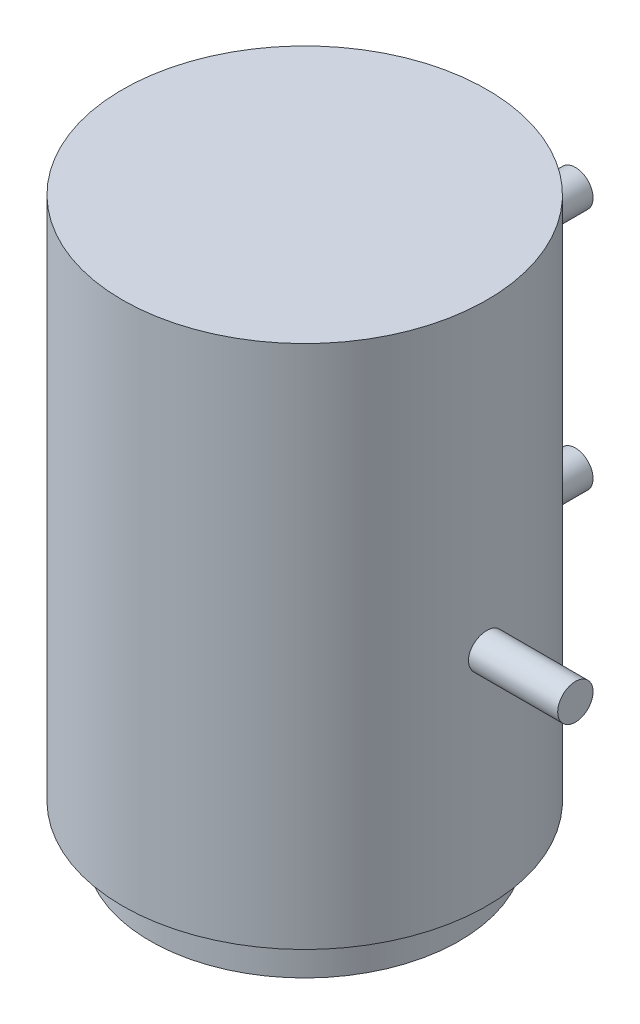
ISO-10303-21;
HEADER;
FILE_DESCRIPTION(('STEP AP214'),'2;1');
FILE_NAME('part.step','',(''),(''),'','','');
FILE_SCHEMA(('AUTOMOTIVE_DESIGN { 1 0 10303 214 1 1 1 1 }'));
ENDSEC;
DATA;
#1=APPLICATION_CONTEXT('core data for automotive mechanical design processes');
#2=APPLICATION_PROTOCOL_DEFINITION('international standard','automotive_design',2000,#1);
#3=PRODUCT_CONTEXT('',#1,'mechanical');
#4=PRODUCT('Part','Part','',(#3));
#5=PRODUCT_RELATED_PRODUCT_CATEGORY('part','',(#4));
#6=PRODUCT_DEFINITION_FORMATION('','',#4);
#7=PRODUCT_DEFINITION_CONTEXT('part definition',#1,'design');
#8=PRODUCT_DEFINITION('design','',#6,#7);
#9=PRODUCT_DEFINITION_SHAPE('','',#8);
#10=(LENGTH_UNIT() NAMED_UNIT(*) SI_UNIT(.MILLI.,.METRE.));
#11=(NAMED_UNIT(*) PLANE_ANGLE_UNIT() SI_UNIT($,.RADIAN.));
#12=(NAMED_UNIT(*) SI_UNIT($,.STERADIAN.) SOLID_ANGLE_UNIT());
#13=UNCERTAINTY_MEASURE_WITH_UNIT(LENGTH_MEASURE(1.E-05),#10,'distance_accuracy_value','');
#14=(GEOMETRIC_REPRESENTATION_CONTEXT(3) GLOBAL_UNCERTAINTY_ASSIGNED_CONTEXT((#13)) GLOBAL_UNIT_ASSIGNED_CONTEXT((#10,
#11,#12)) REPRESENTATION_CONTEXT('',''));
#15=CARTESIAN_POINT('',(0.,0.,0.));
#16=DIRECTION('',(0.,0.,1.));
#17=DIRECTION('',(1.,0.,0.));
#18=AXIS2_PLACEMENT_3D('',#15,#16,#17);
#19=CARTESIAN_POINT('',(0.,47.5,0.));
#20=DIRECTION('',(0.,-1.,0.));
#21=DIRECTION('',(0.,0.,-1.));
#22=AXIS2_PLACEMENT_3D('',#19,#20,#21);
#23=CYLINDRICAL_SURFACE('',#22,16.5);
#24=CARTESIAN_POINT('',(0.,47.5,0.));
#25=DIRECTION('',(0.,1.,0.));
#26=DIRECTION('',(0.,0.,1.));
#27=AXIS2_PLACEMENT_3D('',#24,#25,#26);
#28=CIRCLE('',#27,16.5);
#29=CARTESIAN_POINT('',(0.,47.5,16.5));
#30=VERTEX_POINT('',#29);
#31=EDGE_CURVE('E101',#30,#30,#28,.T.);
#32=ORIENTED_EDGE('',*,*,#31,.F.);
#33=EDGE_LOOP('',(#32));
#34=FACE_BOUND('',#33,.T.);
#35=CARTESIAN_POINT('',(0.,0.,0.));
#36=DIRECTION('',(0.,1.,0.));
#37=DIRECTION('',(0.,0.,1.));
#38=AXIS2_PLACEMENT_3D('',#35,#36,#37);
#39=CIRCLE('',#38,16.5);
#40=CARTESIAN_POINT('',(0.,0.,16.5));
#41=VERTEX_POINT('',#40);
#42=EDGE_CURVE('E105',#41,#41,#39,.T.);
#43=ORIENTED_EDGE('',*,*,#42,.T.);
#44=EDGE_LOOP('',(#43));
#45=FACE_BOUND('',#44,.T.);
#46=CARTESIAN_POINT('',(0.,37.4004609131315,-16.5));
#47=CARTESIAN_POINT('',(0.0896468472072853,37.4004570241778,-16.4999989964101));
#48=CARTESIAN_POINT('',(0.179353307864555,37.3929012788737,-16.4992616357271));
#49=CARTESIAN_POINT('',(0.356280195687039,37.3628734406754,-16.4963910597331));
#50=CARTESIAN_POINT('',(0.44349775702248,37.3403848232219,-16.4942562981101));
#51=CARTESIAN_POINT('',(0.612859080677685,37.2811512184033,-16.4888319477223));
#52=CARTESIAN_POINT('',(0.695005835846317,37.2444147353797,-16.4855430479569));
#53=CARTESIAN_POINT('',(0.851948953325358,37.1577444746024,-16.4781783875371));
#54=CARTESIAN_POINT('',(0.926746794644606,37.1078133598343,-16.4741027857023));
#55=CARTESIAN_POINT('',(1.06714097089595,36.9959891364894,-16.4656059512469));
#56=CARTESIAN_POINT('',(1.13270887311799,36.9340604040171,-16.4611837132571));
#57=CARTESIAN_POINT('',(1.2525376384802,36.8000747446645,-16.452500357178));
#58=CARTESIAN_POINT('',(1.3067979838941,36.7280173542877,-16.4482392464734));
#59=CARTESIAN_POINT('',(1.40257130189849,36.5756428851413,-16.4403502355562));
#60=CARTESIAN_POINT('',(1.44405867624009,36.495309645044,-16.4367236131145));
#61=CARTESIAN_POINT('',(1.51294491511269,36.3287760135604,-16.4305264965383));
#62=CARTESIAN_POINT('',(1.54034410823927,36.2425757590707,-16.4279559777713));
#63=CARTESIAN_POINT('',(1.58019224922932,36.0670441151195,-16.424171089116));
#64=CARTESIAN_POINT('',(1.59268821168734,35.9777234921045,-16.4229524553472));
#65=CARTESIAN_POINT('',(1.60252049054395,35.798245039936,-16.4219960354741));
#66=CARTESIAN_POINT('',(1.59985718310181,35.7080872316116,-16.4222582126252));
#67=CARTESIAN_POINT('',(1.57948529424905,35.5298173734584,-16.424229901502));
#68=CARTESIAN_POINT('',(1.56182799966462,35.4416994005675,-16.4259344794366));
#69=CARTESIAN_POINT('',(1.51204913968636,35.2696835945119,-16.4305911942263));
#70=CARTESIAN_POINT('',(1.47992738941082,35.185785815304,-16.4335433470277));
#71=CARTESIAN_POINT('',(1.40207466745634,35.0244296553668,-16.4403682565936));
#72=CARTESIAN_POINT('',(1.35632089164593,34.9469823452025,-16.4442425537518));
#73=CARTESIAN_POINT('',(1.25251929679395,34.800846695686,-16.4524738914759));
#74=CARTESIAN_POINT('',(1.19447113953268,34.7321585973838,-16.4568309453208));
#75=CARTESIAN_POINT('',(1.06744187143553,34.6051931136989,-16.4655588452169));
#76=CARTESIAN_POINT('',(0.998416459169538,34.546960041591,-16.4699296736173));
#77=CARTESIAN_POINT('',(0.851546032359735,34.4429009313146,-16.478175564523));
#78=CARTESIAN_POINT('',(0.77370100880076,34.3970749058284,-16.4820506265215));
#79=CARTESIAN_POINT('',(0.611370762232357,34.3191326903597,-16.488869533322));
#80=CARTESIAN_POINT('',(0.526884479833608,34.2870186929462,-16.4918132291781));
#81=CARTESIAN_POINT('',(0.353684201743435,34.2374443253599,-16.496436175699));
#82=CARTESIAN_POINT('',(0.264970324988621,34.2199835431994,-16.4981154619138));
#83=CARTESIAN_POINT('',(0.0862169415722778,34.2002673420357,-16.5000158131697));
#84=CARTESIAN_POINT('',(-0.00381575943655131,34.1979507624561,-16.5002427435404));
#85=CARTESIAN_POINT('',(-0.182988154084999,34.2084281703873,-16.4992285294652));
#86=CARTESIAN_POINT('',(-0.272127859042658,34.2212219661408,-16.4979874036497));
#87=CARTESIAN_POINT('',(-0.446807802909054,34.2615062255212,-16.4941803263464));
#88=CARTESIAN_POINT('',(-0.532354693905177,34.2889681085695,-16.4916169515754));
#89=CARTESIAN_POINT('',(-0.697627281978256,34.3577796640838,-16.485453026532));
#90=CARTESIAN_POINT('',(-0.77735285590424,34.399129630251,-16.4818524543256));
#91=CARTESIAN_POINT('',(-0.928996572726879,34.4946956503564,-16.4740024388171));
#92=CARTESIAN_POINT('',(-1.00088924495442,34.5489519528979,-16.4697509808044));
#93=CARTESIAN_POINT('',(-1.13456870258934,34.6687327147321,-16.4610828889791));
#94=CARTESIAN_POINT('',(-1.19635524964773,34.7342574397112,-16.4566662512739));
#95=CARTESIAN_POINT('',(-1.30828042110192,34.874981619016,-16.4481479900473));
#96=CARTESIAN_POINT('',(-1.35837895009174,34.9502130403065,-16.4440474822902));
#97=CARTESIAN_POINT('',(-1.44523047769575,35.1080571154782,-16.4366425072072));
#98=CARTESIAN_POINT('',(-1.48198364934787,35.190669673637,-16.4333380295601));
#99=CARTESIAN_POINT('',(-1.5410338209711,35.3607925786967,-16.4279060941151));
#100=CARTESIAN_POINT('',(-1.56335481172441,35.4482945334059,-16.4257766838572));
#101=CARTESIAN_POINT('',(-1.59298490511546,35.6258260097101,-16.422929829592));
#102=CARTESIAN_POINT('',(-1.60029441033257,35.7158554634567,-16.4222123477195));
#103=CARTESIAN_POINT('',(-1.59968864115444,35.8954878261391,-16.4222713363689));
#104=CARTESIAN_POINT('',(-1.59183635355644,35.9850909561852,-16.4230416262288));
#105=CARTESIAN_POINT('',(-1.56126182021458,36.1616989004317,-16.4259761965129));
#106=CARTESIAN_POINT('',(-1.53853955645238,36.2487037114835,-16.4281404786262));
#107=CARTESIAN_POINT('',(-1.47888718274058,36.4176456691619,-16.4336174761021));
#108=CARTESIAN_POINT('',(-1.44195878646557,36.49958342564,-16.436930052942));
#109=CARTESIAN_POINT('',(-1.3549489913268,36.656107477535,-16.4443306725105));
#110=CARTESIAN_POINT('',(-1.30486769187971,36.7306938285118,-16.4484187093778));
#111=CARTESIAN_POINT('',(-1.19273704605056,36.8707206126834,-16.456929952389));
#112=CARTESIAN_POINT('',(-1.13064080117923,36.9361234140011,-16.4613544292931));
#113=CARTESIAN_POINT('',(-0.996334643101315,37.0556090403434,-16.4700284061561));
#114=CARTESIAN_POINT('',(-0.92412230630098,37.1096891449304,-16.4742778638676));
#115=CARTESIAN_POINT('',(-0.771446831714418,37.2050943872768,-16.4821334291007));
#116=CARTESIAN_POINT('',(-0.690964405934935,37.2463887629259,-16.4857379763316));
#117=CARTESIAN_POINT('',(-0.524225147989652,37.3148226400725,-16.4918804097023));
#118=CARTESIAN_POINT('',(-0.437974976842079,37.3419781621515,-16.4944195024607));
#119=CARTESIAN_POINT('',(-0.292693706489168,37.374563878306,-16.4975042386956));
#120=CARTESIAN_POINT('',(-0.234592456617577,37.3842620682817,-16.4984358052133));
#121=CARTESIAN_POINT('',(-0.117669365334526,37.3972118498036,-16.4996840140874));
#122=CARTESIAN_POINT('',(-0.0588475266776659,37.4004634659854,-16.5000006587937));
#123=CARTESIAN_POINT('',(0.,37.4004609131315,-16.5));
#124=B_SPLINE_CURVE_WITH_KNOTS('',3,(#46,#47,#48,#49,#50,#51,#52,#53,#54,#55,#56,#57,#58,#59,
#60,#61,#62,#63,#64,#65,#66,#67,#68,#69,#70,#71,#72,#73,#74,#75,#76,#77,#78,#79,#80,#81,#82,#83,
#84,#85,#86,#87,#88,#89,#90,#91,#92,#93,#94,#95,#96,#97,#98,#99,#100,#101,#102,#103,#104,#105,
#106,#107,#108,#109,#110,#111,#112,#113,#114,#115,#116,#117,#118,#119,#120,#121,#122,#123),
.UNSPECIFIED.,.T.,.F.,(4,2,2,2,2,2,2,2,2,2,2,2,2,2,2,2,2,2,2,2,2,2,2,2,2,2,2,2,2,2,2,2,2,2,2,2,
2,2,4),(0.,0.268725658635273,0.537749182932134,0.806612377559469,1.07542135069024,
1.34504106801601,1.61467312740271,1.88484208947143,2.15500474977871,2.42431286573799,
2.69361429916557,2.96199828226717,3.23038569589546,3.49922462258241,3.76807094601671,
4.03803116582555,4.30799166158281,4.57799530818037,4.8479913631363,5.11689634910566,
5.38579792258758,5.65417744604397,5.92256264547172,6.19179604156716,6.46103578651109,
6.73118599811129,7.00133270677795,7.27102918497383,7.54071843033076,7.80928971291711,
8.07786132093895,8.34640054153298,8.6149377324228,8.8845450701213,9.1542171106424,
9.4245330213863,9.69454196985751,9.87094416682508,10.0473456896689),.UNSPECIFIED.);
#125=CARTESIAN_POINT('',(0.,37.4004609131315,-16.5));
#126=VERTEX_POINT('',#125);
#127=EDGE_CURVE('E46',#126,#126,#124,.T.);
#128=ORIENTED_EDGE('',*,*,#127,.F.);
#129=EDGE_LOOP('',(#128));
#130=FACE_BOUND('',#129,.T.);
#131=CARTESIAN_POINT('',(0.,15.4004609131315,-16.5));
#132=CARTESIAN_POINT('',(0.089646847207285,15.4004570241778,-16.4999989964101));
#133=CARTESIAN_POINT('',(0.179353307864555,15.3929012788737,-16.4992616357271));
#134=CARTESIAN_POINT('',(0.356280195687038,15.3628734406754,-16.4963910597331));
#135=CARTESIAN_POINT('',(0.443497757022479,15.3403848232219,-16.4942562981101));
#136=CARTESIAN_POINT('',(0.612859080677684,15.2811512184033,-16.4888319477223));
#137=CARTESIAN_POINT('',(0.695005835846316,15.2444147353797,-16.4855430479569));
#138=CARTESIAN_POINT('',(0.851948953325356,15.1577444746024,-16.4781783875371));
#139=CARTESIAN_POINT('',(0.926746794644603,15.1078133598343,-16.4741027857023));
#140=CARTESIAN_POINT('',(1.06714097089594,14.9959891364894,-16.4656059512469));
#141=CARTESIAN_POINT('',(1.13270887311799,14.9340604040171,-16.4611837132571));
#142=CARTESIAN_POINT('',(1.2525376384802,14.8000747446645,-16.452500357178));
#143=CARTESIAN_POINT('',(1.3067979838941,14.7280173542877,-16.4482392464734));
#144=CARTESIAN_POINT('',(1.40257130189849,14.5756428851413,-16.4403502355562));
#145=CARTESIAN_POINT('',(1.44405867624009,14.495309645044,-16.4367236131145));
#146=CARTESIAN_POINT('',(1.51294491511269,14.3287760135604,-16.4305264965383));
#147=CARTESIAN_POINT('',(1.54034410823927,14.2425757590707,-16.4279559777713));
#148=CARTESIAN_POINT('',(1.58019224922932,14.0670441151195,-16.424171089116));
#149=CARTESIAN_POINT('',(1.59268821168734,13.9777234921045,-16.4229524553472));
#150=CARTESIAN_POINT('',(1.60252049054395,13.798245039936,-16.4219960354741));
#151=CARTESIAN_POINT('',(1.59985718310181,13.7080872316116,-16.4222582126252));
#152=CARTESIAN_POINT('',(1.57948529424905,13.5298173734584,-16.424229901502));
#153=CARTESIAN_POINT('',(1.56182799966462,13.4416994005675,-16.4259344794366));
#154=CARTESIAN_POINT('',(1.51204913968636,13.2696835945119,-16.4305911942263));
#155=CARTESIAN_POINT('',(1.47992738941082,13.185785815304,-16.4335433470277));
#156=CARTESIAN_POINT('',(1.40207466745633,13.0244296553668,-16.4403682565936));
#157=CARTESIAN_POINT('',(1.35632089164593,12.9469823452025,-16.4442425537518));
#158=CARTESIAN_POINT('',(1.25251929679395,12.800846695686,-16.4524738914759));
#159=CARTESIAN_POINT('',(1.19447113953268,12.7321585973838,-16.4568309453208));
#160=CARTESIAN_POINT('',(1.06744187143554,12.6051931136989,-16.4655588452169));
#161=CARTESIAN_POINT('',(0.998416459169544,12.546960041591,-16.4699296736173));
#162=CARTESIAN_POINT('',(0.851546032359739,12.4429009313146,-16.478175564523));
#163=CARTESIAN_POINT('',(0.773701008800762,12.3970749058284,-16.4820506265215));
#164=CARTESIAN_POINT('',(0.611370762232358,12.3191326903597,-16.488869533322));
#165=CARTESIAN_POINT('',(0.526884479833609,12.2870186929462,-16.4918132291781));
#166=CARTESIAN_POINT('',(0.353684201743438,12.2374443253599,-16.496436175699));
#167=CARTESIAN_POINT('',(0.264970324988624,12.2199835431994,-16.4981154619138));
#168=CARTESIAN_POINT('',(0.0862169415722799,12.2002673420357,-16.5000158131697));
#169=CARTESIAN_POINT('',(-0.00381575943654948,12.1979507624561,-16.5002427435404));
#170=CARTESIAN_POINT('',(-0.182988154084997,12.2084281703873,-16.4992285294652));
#171=CARTESIAN_POINT('',(-0.272127859042657,12.2212219661408,-16.4979874036497));
#172=CARTESIAN_POINT('',(-0.446807802909053,12.2615062255212,-16.4941803263464));
#173=CARTESIAN_POINT('',(-0.532354693905176,12.2889681085695,-16.4916169515754));
#174=CARTESIAN_POINT('',(-0.697627281978256,12.3577796640838,-16.485453026532));
#175=CARTESIAN_POINT('',(-0.77735285590424,12.399129630251,-16.4818524543256));
#176=CARTESIAN_POINT('',(-0.928996572726878,12.4946956503564,-16.4740024388171));
#177=CARTESIAN_POINT('',(-1.00088924495442,12.5489519528979,-16.4697509808044));
#178=CARTESIAN_POINT('',(-1.13456870258934,12.6687327147321,-16.4610828889791));
#179=CARTESIAN_POINT('',(-1.19635524964773,12.7342574397112,-16.4566662512739));
#180=CARTESIAN_POINT('',(-1.30828042110192,12.874981619016,-16.4481479900473));
#181=CARTESIAN_POINT('',(-1.35837895009174,12.9502130403065,-16.4440474822902));
#182=CARTESIAN_POINT('',(-1.44523047769575,13.1080571154781,-16.4366425072072));
#183=CARTESIAN_POINT('',(-1.48198364934786,13.190669673637,-16.4333380295601));
#184=CARTESIAN_POINT('',(-1.5410338209711,13.3607925786967,-16.4279060941151));
#185=CARTESIAN_POINT('',(-1.56335481172441,13.4482945334059,-16.4257766838572));
#186=CARTESIAN_POINT('',(-1.59298490511546,13.6258260097101,-16.422929829592));
#187=CARTESIAN_POINT('',(-1.60029441033257,13.7158554634567,-16.4222123477195));
#188=CARTESIAN_POINT('',(-1.59968864115444,13.8954878261391,-16.4222713363689));
#189=CARTESIAN_POINT('',(-1.59183635355644,13.9850909561852,-16.4230416262288));
#190=CARTESIAN_POINT('',(-1.56126182021458,14.1616989004317,-16.4259761965129));
#191=CARTESIAN_POINT('',(-1.53853955645238,14.2487037114835,-16.4281404786262));
#192=CARTESIAN_POINT('',(-1.47888718274058,14.4176456691619,-16.4336174761021));
#193=CARTESIAN_POINT('',(-1.44195878646557,14.49958342564,-16.436930052942));
#194=CARTESIAN_POINT('',(-1.35494899132681,14.656107477535,-16.4443306725105));
#195=CARTESIAN_POINT('',(-1.30486769187971,14.7306938285118,-16.4484187093778));
#196=CARTESIAN_POINT('',(-1.19273704605056,14.8707206126835,-16.456929952389));
#197=CARTESIAN_POINT('',(-1.13064080117923,14.9361234140011,-16.4613544292931));
#198=CARTESIAN_POINT('',(-0.996334643101315,15.0556090403434,-16.4700284061561));
#199=CARTESIAN_POINT('',(-0.924122306300983,15.1096891449304,-16.4742778638676));
#200=CARTESIAN_POINT('',(-0.771446831714421,15.2050943872768,-16.4821334291007));
#201=CARTESIAN_POINT('',(-0.690964405934937,15.2463887629259,-16.4857379763316));
#202=CARTESIAN_POINT('',(-0.524225147989652,15.3148226400725,-16.4918804097023));
#203=CARTESIAN_POINT('',(-0.43797497684208,15.3419781621515,-16.4944195024607));
#204=CARTESIAN_POINT('',(-0.292693706489168,15.374563878306,-16.4975042386956));
#205=CARTESIAN_POINT('',(-0.234592456617577,15.3842620682817,-16.4984358052133));
#206=CARTESIAN_POINT('',(-0.117669365334526,15.3972118498036,-16.4996840140874));
#207=CARTESIAN_POINT('',(-0.0588475266776659,15.4004634659854,-16.5000006587937));
#208=CARTESIAN_POINT('',(0.,15.4004609131315,-16.5));
#209=B_SPLINE_CURVE_WITH_KNOTS('',3,(#131,#132,#133,#134,#135,#136,#137,#138,#139,#140,#141,
#142,#143,#144,#145,#146,#147,#148,#149,#150,#151,#152,#153,#154,#155,#156,#157,#158,#159,#160,
#161,#162,#163,#164,#165,#166,#167,#168,#169,#170,#171,#172,#173,#174,#175,#176,#177,#178,#179,
#180,#181,#182,#183,#184,#185,#186,#187,#188,#189,#190,#191,#192,#193,#194,#195,#196,#197,#198,
#199,#200,#201,#202,#203,#204,#205,#206,#207,#208),.UNSPECIFIED.,.T.,.F.,(4,2,2,2,2,2,2,2,2,2,2,
2,2,2,2,2,2,2,2,2,2,2,2,2,2,2,2,2,2,2,2,2,2,2,2,2,2,2,4),(0.,0.268725658635273,
0.537749182932134,0.806612377559468,1.07542135069024,1.345041068016,1.61467312740271,
1.88484208947143,2.15500474977871,2.42431286573799,2.69361429916557,2.96199828226717,
3.23038569589547,3.49922462258241,3.7680709460167,4.03803116582555,4.30799166158281,
4.57799530818037,4.8479913631363,5.11689634910566,5.38579792258758,5.65417744604397,
5.92256264547172,6.19179604156716,6.4610357865111,6.73118599811129,7.00133270677795,
7.27102918497383,7.54071843033076,7.80928971291711,8.07786132093895,8.34640054153298,
8.61493773242281,8.88454507012131,9.1542171106424,9.42453302138631,9.69454196985751,
9.87094416682509,10.0473456896689),.UNSPECIFIED.);
#210=CARTESIAN_POINT('',(0.,15.4004609131315,-16.5));
#211=VERTEX_POINT('',#210);
#212=EDGE_CURVE('E42',#211,#211,#209,.T.);
#213=ORIENTED_EDGE('',*,*,#212,.F.);
#214=EDGE_LOOP('',(#213));
#215=FACE_BOUND('',#214,.T.);
#216=CARTESIAN_POINT('',(16.4222410163778,20.,1.6));
#217=CARTESIAN_POINT('',(16.4222420376795,19.9103542700558,1.5999961100457));
#218=CARTESIAN_POINT('',(16.4229829627764,19.8206489231285,1.59244054671001));
#219=CARTESIAN_POINT('',(16.4258662715848,19.6437243493353,1.56241349700949));
#220=CARTESIAN_POINT('',(16.4280102082224,19.5565079891743,1.53992548222532));
#221=CARTESIAN_POINT('',(16.4334544597147,19.3871492053935,1.48069364041224));
#222=CARTESIAN_POINT('',(16.4367540822898,19.3050037787539,1.44395834638579));
#223=CARTESIAN_POINT('',(16.4441370665982,19.1480628871906,1.35729088559525));
#224=CARTESIAN_POINT('',(16.4482202703096,19.0732659449152,1.30736137889637));
#225=CARTESIAN_POINT('',(16.4567260260862,18.9328707529999,1.19553877974908));
#226=CARTESIAN_POINT('',(16.4611495740653,18.8673012209481,1.13360970416182));
#227=CARTESIAN_POINT('',(16.4698285411595,18.7474693101254,0.999622674319128));
#228=CARTESIAN_POINT('',(16.4740839526436,18.6932074440818,0.927564261013812));
#229=CARTESIAN_POINT('',(16.4819569453983,18.5974325363164,0.775188896073503));
#230=CARTESIAN_POINT('',(16.4855732539769,18.5559448134632,0.694855959014567));
#231=CARTESIAN_POINT('',(16.4917497615437,18.4870578466628,0.528322986192983));
#232=CARTESIAN_POINT('',(16.4943099848543,18.4596582782513,0.442123085604116));
#233=CARTESIAN_POINT('',(16.4980788690668,18.4198093525272,0.266592523186787));
#234=CARTESIAN_POINT('',(16.4992917824041,18.407312947984,0.177272634766345));
#235=CARTESIAN_POINT('',(16.5002438371471,18.3974795304425,-0.00220437922728813));
#236=CARTESIAN_POINT('',(16.4999830146577,18.4001421460647,-0.0923614842355567));
#237=CARTESIAN_POINT('',(16.498020471342,18.4205129402298,-0.270634395090831));
#238=CARTESIAN_POINT('',(16.4963235955762,18.4381705283399,-0.358756042559228));
#239=CARTESIAN_POINT('',(16.4916852459236,18.4879512493168,-0.530779046243167));
#240=CARTESIAN_POINT('',(16.4887437567005,18.5200745604345,-0.614680350440227));
#241=CARTESIAN_POINT('',(16.4819385956142,18.5979305129298,-0.776040780982717));
#242=CARTESIAN_POINT('',(16.4780734053059,18.6436855940511,-0.853489013581677));
#243=CARTESIAN_POINT('',(16.4698546770478,18.7474899741403,-0.999625954256123));
#244=CARTESIAN_POINT('',(16.4655011256383,18.8055396119998,-1.06831442079053));
#245=CARTESIAN_POINT('',(16.4567732255967,18.9325699294784,-1.19527822970595));
#246=CARTESIAN_POINT('',(16.4523988651053,19.0015946084457,-1.25350955783061));
#247=CARTESIAN_POINT('',(16.4441402698179,19.1484629470202,-1.35756549890588));
#248=CARTESIAN_POINT('',(16.4402560356651,19.2263066182021,-1.40339009557295));
#249=CARTESIAN_POINT('',(16.4334170564632,19.3886365002109,-1.48133128351168));
#250=CARTESIAN_POINT('',(16.4304624900536,19.4731239837803,-1.51344524064959));
#251=CARTESIAN_POINT('',(16.4258210308705,19.6463268725018,-1.56301915952283));
#252=CARTESIAN_POINT('',(16.4241341018278,19.7350421566121,-1.58047954052333));
#253=CARTESIAN_POINT('',(16.4222251234915,19.9137961918413,-1.60019422888749));
#254=CARTESIAN_POINT('',(16.4219971460669,20.0038280953258,-1.60251007360554));
#255=CARTESIAN_POINT('',(16.4230162391209,20.1829987183217,-1.59203148062513));
#256=CARTESIAN_POINT('',(16.4242632908787,20.2721374491547,-1.57923723470056));
#257=CARTESIAN_POINT('',(16.4280865354117,20.446812561992,-1.53895309163706));
#258=CARTESIAN_POINT('',(16.4306601028451,20.5323556997887,-1.51149221773348));
#259=CARTESIAN_POINT('',(16.436844263213,20.6976212279995,-1.4426839376655));
#260=CARTESIAN_POINT('',(16.4404548785246,20.7773434927657,-1.4013362318511));
#261=CARTESIAN_POINT('',(16.4483206637351,20.9289849584916,-1.30577353666536));
#262=CARTESIAN_POINT('',(16.452577862737,21.0008783264548,-1.25151772438993));
#263=CARTESIAN_POINT('',(16.4612504523987,21.1345594162475,-1.13173753828309));
#264=CARTESIAN_POINT('',(16.4656658467391,21.1963469027757,-1.06621290214565));
#265=CARTESIAN_POINT('',(16.4741751708781,21.3082740991971,-0.925488311946787));
#266=CARTESIAN_POINT('',(16.4782679625952,21.3583736963507,-0.850256375296736));
#267=CARTESIAN_POINT('',(16.4856543983465,21.4452270982127,-0.692410985067064));
#268=CARTESIAN_POINT('',(16.4889480527602,21.4819810762628,-0.609797627379674));
#269=CARTESIAN_POINT('',(16.4943599493237,21.5410317822897,-0.439675231175437));
#270=CARTESIAN_POINT('',(16.4964801695201,21.5633528504425,-0.352174706787022));
#271=CARTESIAN_POINT('',(16.4993144062075,21.5929835833124,-0.174646246646755));
#272=CARTESIAN_POINT('',(16.5000284596945,21.6002936429675,-0.0846183774522526));
#273=CARTESIAN_POINT('',(16.4999699045679,21.5996894890627,0.0950149409466967));
#274=CARTESIAN_POINT('',(16.4992033813506,21.5918375934904,0.18462060825982));
#275=CARTESIAN_POINT('',(16.4962818105271,21.56126295154,0.36123372480879));
#276=CARTESIAN_POINT('',(16.4941267616573,21.5385401916284,0.44824117168002));
#277=CARTESIAN_POINT('',(16.4886696603457,21.4788858334337,0.617188405209422));
#278=CARTESIAN_POINT('',(16.4853677443889,21.4419559258427,0.69912879351611));
#279=CARTESIAN_POINT('',(16.4779852351362,21.3549422934563,0.855657478252444));
#280=CARTESIAN_POINT('',(16.4739046478982,21.3048586709937,0.930245831872932));
#281=CARTESIAN_POINT('',(16.4654020626549,21.1927254720806,1.07027249465193));
#282=CARTESIAN_POINT('',(16.4609787828649,21.130629528307,1.13567359564538));
#283=CARTESIAN_POINT('',(16.4523002117134,20.9963246717722,1.25515593208936));
#284=CARTESIAN_POINT('',(16.4480449609892,20.9241133316064,1.30923444264968));
#285=CARTESIAN_POINT('',(16.4401732420165,20.7714386671607,1.40463797168084));
#286=CARTESIAN_POINT('',(16.4365583378983,20.6909558756142,1.4459319411375));
#287=CARTESIAN_POINT('',(16.4303953133504,20.5242158414438,1.51436495751699));
#288=CARTESIAN_POINT('',(16.4278459857618,20.4379652622207,1.5415200305797));
#289=CARTESIAN_POINT('',(16.4247481579386,20.2926851934447,1.57410448007729));
#290=CARTESIAN_POINT('',(16.4238124016309,20.234585642774,1.58380209996328));
#291=CARTESIAN_POINT('',(16.4225584968456,20.1176659557669,1.59675112413559));
#292=CARTESIAN_POINT('',(16.4222403459683,20.0588458222312,1.60000255346863));
#293=CARTESIAN_POINT('',(16.4222410163778,20.,1.6));
#294=B_SPLINE_CURVE_WITH_KNOTS('',3,(#216,#217,#218,#219,#220,#221,#222,#223,#224,#225,#226,
#227,#228,#229,#230,#231,#232,#233,#234,#235,#236,#237,#238,#239,#240,#241,#242,#243,#244,#245,
#246,#247,#248,#249,#250,#251,#252,#253,#254,#255,#256,#257,#258,#259,#260,#261,#262,#263,#264,
#265,#266,#267,#268,#269,#270,#271,#272,#273,#274,#275,#276,#277,#278,#279,#280,#281,#282,#283,
#284,#285,#286,#287,#288,#289,#290,#291,#292,#293),.UNSPECIFIED.,.T.,.F.,(4,2,2,2,2,2,2,2,2,2,2,
2,2,2,2,2,2,2,2,2,2,2,2,2,2,2,2,2,2,2,2,2,2,2,2,2,2,2,4),(0.,0.268722302678001,
0.537742545400164,0.806601914300762,1.07540712017089,1.34503122908261,1.61466756098911,
1.88483493293676,2.15499608238261,2.42430209353688,2.69360150701444,2.96199594428521,
3.23039368888218,3.49923571699405,3.76808515653226,4.03804093926535,4.30799707630743,
4.57800505490804,4.84800530783127,5.11690777341823,5.38580682619181,5.65417572569761,
5.92255041643857,6.1917854181096,6.46102668765068,6.73117882657196,7.00132745645001,
7.27101930149329,7.54070405088148,7.8092827131112,8.07786161976454,8.34640857462457,
8.61495344031611,8.8845563482377,9.15422406430124,9.42454165893983,9.69455218360321,
9.87094927809301,10.047345687189),.UNSPECIFIED.);
#295=CARTESIAN_POINT('',(16.4222410163778,20.,1.6));
#296=VERTEX_POINT('',#295);
#297=EDGE_CURVE('E10',#296,#296,#294,.T.);
#298=ORIENTED_EDGE('',*,*,#297,.F.);
#299=EDGE_LOOP('',(#298));
#300=FACE_BOUND('',#299,.T.);
#301=ADVANCED_FACE('F31',(#34,#45,#130,#215,#300),#23,.T.);
#302=CARTESIAN_POINT('',(0.,47.5,0.));
#303=DIRECTION('',(0.,1.,0.));
#304=DIRECTION('',(0.,0.,1.));
#305=AXIS2_PLACEMENT_3D('',#302,#303,#304);
#306=PLANE('',#305);
#307=ORIENTED_EDGE('',*,*,#31,.T.);
#308=EDGE_LOOP('',(#307));
#309=FACE_BOUND('',#308,.T.);
#310=ADVANCED_FACE('F85',(#309),#306,.T.);
#311=CARTESIAN_POINT('',(0.,0.,0.));
#312=DIRECTION('',(0.,1.,0.));
#313=DIRECTION('',(0.,0.,1.));
#314=AXIS2_PLACEMENT_3D('',#311,#312,#313);
#315=PLANE('',#314);
#316=CARTESIAN_POINT('',(0.,0.,0.));
#317=DIRECTION('',(0.,-1.,0.));
#318=DIRECTION('',(0.,0.,-1.));
#319=AXIS2_PLACEMENT_3D('',#316,#317,#318);
#320=CIRCLE('',#319,14.);
#321=CARTESIAN_POINT('',(0.,0.,-14.));
#322=VERTEX_POINT('',#321);
#323=EDGE_CURVE('E50',#322,#322,#320,.T.);
#324=ORIENTED_EDGE('',*,*,#323,.F.);
#325=EDGE_LOOP('',(#324));
#326=FACE_BOUND('',#325,.T.);
#327=ORIENTED_EDGE('',*,*,#42,.F.);
#328=EDGE_LOOP('',(#327));
#329=FACE_BOUND('',#328,.T.);
#330=ADVANCED_FACE('F83',(#326,#329),#315,.F.);
#331=CARTESIAN_POINT('',(0.,-4.,0.));
#332=DIRECTION('',(0.,1.,0.));
#333=DIRECTION('',(0.,0.,1.));
#334=AXIS2_PLACEMENT_3D('',#331,#332,#333);
#335=CYLINDRICAL_SURFACE('',#334,14.);
#336=CARTESIAN_POINT('',(0.,-4.,0.));
#337=DIRECTION('',(0.,-1.,0.));
#338=DIRECTION('',(0.,0.,-1.));
#339=AXIS2_PLACEMENT_3D('',#336,#337,#338);
#340=CIRCLE('',#339,14.);
#341=CARTESIAN_POINT('',(0.,-4.,-14.));
#342=VERTEX_POINT('',#341);
#343=EDGE_CURVE('E110',#342,#342,#340,.T.);
#344=ORIENTED_EDGE('',*,*,#343,.F.);
#345=EDGE_LOOP('',(#344));
#346=FACE_BOUND('',#345,.T.);
#347=ORIENTED_EDGE('',*,*,#323,.T.);
#348=EDGE_LOOP('',(#347));
#349=FACE_BOUND('',#348,.T.);
#350=ADVANCED_FACE('F79',(#346,#349),#335,.T.);
#351=CARTESIAN_POINT('',(0.,-4.,0.));
#352=DIRECTION('',(0.,-1.,0.));
#353=DIRECTION('',(0.,0.,-1.));
#354=AXIS2_PLACEMENT_3D('',#351,#352,#353);
#355=PLANE('',#354);
#356=ORIENTED_EDGE('',*,*,#343,.T.);
#357=EDGE_LOOP('',(#356));
#358=FACE_BOUND('',#357,.T.);
#359=ADVANCED_FACE('F75',(#358),#355,.T.);
#360=CARTESIAN_POINT('',(0.,35.8004609131315,-24.5));
#361=DIRECTION('',(0.,0.,1.));
#362=DIRECTION('',(1.,0.,0.));
#363=AXIS2_PLACEMENT_3D('',#360,#361,#362);
#364=CYLINDRICAL_SURFACE('',#363,1.6);
#365=CARTESIAN_POINT('',(0.,35.8004609131315,-24.5));
#366=DIRECTION('',(0.,0.,-1.));
#367=DIRECTION('',(-1.,0.,0.));
#368=AXIS2_PLACEMENT_3D('',#365,#366,#367);
#369=CIRCLE('',#368,1.6);
#370=CARTESIAN_POINT('',(-1.6,35.8004609131315,-24.5));
#371=VERTEX_POINT('',#370);
#372=EDGE_CURVE('E113',#371,#371,#369,.T.);
#373=ORIENTED_EDGE('',*,*,#372,.F.);
#374=EDGE_LOOP('',(#373));
#375=FACE_BOUND('',#374,.T.);
#376=ORIENTED_EDGE('',*,*,#127,.T.);
#377=EDGE_LOOP('',(#376));
#378=FACE_BOUND('',#377,.T.);
#379=ADVANCED_FACE('F70',(#375,#378),#364,.T.);
#380=CARTESIAN_POINT('',(0.,35.8004609131315,-24.5));
#381=DIRECTION('',(0.,0.,-1.));
#382=DIRECTION('',(-1.,0.,0.));
#383=AXIS2_PLACEMENT_3D('',#380,#381,#382);
#384=PLANE('',#383);
#385=ORIENTED_EDGE('',*,*,#372,.T.);
#386=EDGE_LOOP('',(#385));
#387=FACE_BOUND('',#386,.T.);
#388=ADVANCED_FACE('F67',(#387),#384,.T.);
#389=CARTESIAN_POINT('',(0.,13.8004609131315,-24.5));
#390=DIRECTION('',(0.,0.,1.));
#391=DIRECTION('',(1.,0.,0.));
#392=AXIS2_PLACEMENT_3D('',#389,#390,#391);
#393=CYLINDRICAL_SURFACE('',#392,1.6);
#394=CARTESIAN_POINT('',(0.,13.8004609131315,-24.5));
#395=DIRECTION('',(0.,0.,-1.));
#396=DIRECTION('',(-1.,0.,0.));
#397=AXIS2_PLACEMENT_3D('',#394,#395,#396);
#398=CIRCLE('',#397,1.6);
#399=CARTESIAN_POINT('',(-1.6,13.8004609131315,-24.5));
#400=VERTEX_POINT('',#399);
#401=EDGE_CURVE('E120',#400,#400,#398,.T.);
#402=ORIENTED_EDGE('',*,*,#401,.F.);
#403=EDGE_LOOP('',(#402));
#404=FACE_BOUND('',#403,.T.);
#405=ORIENTED_EDGE('',*,*,#212,.T.);
#406=EDGE_LOOP('',(#405));
#407=FACE_BOUND('',#406,.T.);
#408=ADVANCED_FACE('F61',(#404,#407),#393,.T.);
#409=CARTESIAN_POINT('',(0.,13.8004609131315,-24.5));
#410=DIRECTION('',(0.,0.,-1.));
#411=DIRECTION('',(-1.,0.,0.));
#412=AXIS2_PLACEMENT_3D('',#409,#410,#411);
#413=PLANE('',#412);
#414=ORIENTED_EDGE('',*,*,#401,.T.);
#415=EDGE_LOOP('',(#414));
#416=FACE_BOUND('',#415,.T.);
#417=ADVANCED_FACE('F66',(#416),#413,.T.);
#418=CARTESIAN_POINT('',(24.5,20.,0.));
#419=DIRECTION('',(-1.,0.,0.));
#420=DIRECTION('',(0.,0.,1.));
#421=AXIS2_PLACEMENT_3D('',#418,#419,#420);
#422=CYLINDRICAL_SURFACE('',#421,1.6);
#423=CARTESIAN_POINT('',(24.5,20.,0.));
#424=DIRECTION('',(1.,0.,0.));
#425=DIRECTION('',(0.,0.,-1.));
#426=AXIS2_PLACEMENT_3D('',#423,#424,#425);
#427=CIRCLE('',#426,1.6);
#428=CARTESIAN_POINT('',(24.5,20.,-1.6));
#429=VERTEX_POINT('',#428);
#430=EDGE_CURVE('E123',#429,#429,#427,.T.);
#431=ORIENTED_EDGE('',*,*,#430,.F.);
#432=EDGE_LOOP('',(#431));
#433=FACE_BOUND('',#432,.T.);
#434=ORIENTED_EDGE('',*,*,#297,.T.);
#435=EDGE_LOOP('',(#434));
#436=FACE_BOUND('',#435,.T.);
#437=ADVANCED_FACE('F129',(#433,#436),#422,.T.);
#438=CARTESIAN_POINT('',(24.5,20.,0.));
#439=DIRECTION('',(1.,0.,0.));
#440=DIRECTION('',(0.,0.,-1.));
#441=AXIS2_PLACEMENT_3D('',#438,#439,#440);
#442=PLANE('',#441);
#443=ORIENTED_EDGE('',*,*,#430,.T.);
#444=EDGE_LOOP('',(#443));
#445=FACE_BOUND('',#444,.T.);
#446=ADVANCED_FACE('F127',(#445),#442,.T.);
#447=CLOSED_SHELL('',(#301,#310,#330,#350,#359,#379,#388,#408,#417,#437,#446));
#448=MANIFOLD_SOLID_BREP('B2',#447);
#449=ADVANCED_BREP_SHAPE_REPRESENTATION('',(#18,#448),#14);
#450=SHAPE_DEFINITION_REPRESENTATION(#9,#449);
ENDSEC;
END-ISO-10303-21;
